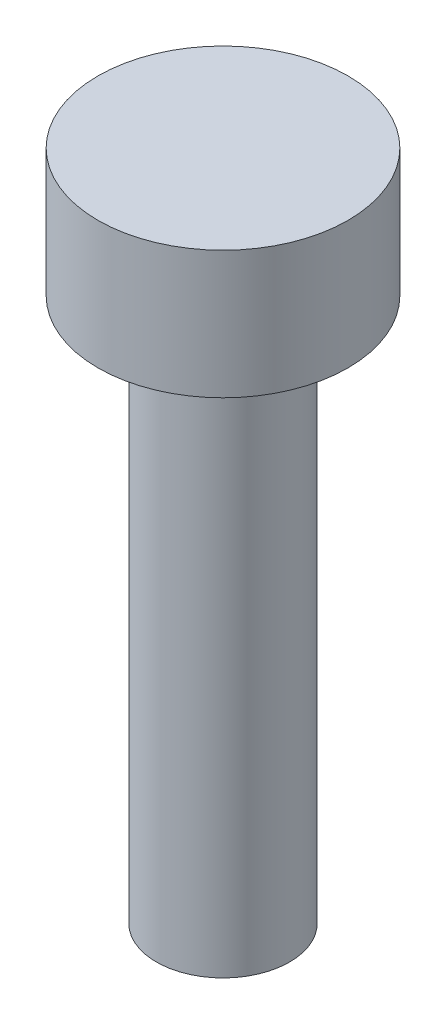
ISO-10303-21;
HEADER;
FILE_DESCRIPTION(('STEP AP214'),'2;1');
FILE_NAME('part.step','',(''),(''),'','','');
FILE_SCHEMA(('AUTOMOTIVE_DESIGN { 1 0 10303 214 1 1 1 1 }'));
ENDSEC;
DATA;
#1=APPLICATION_CONTEXT('core data for automotive mechanical design processes');
#2=APPLICATION_PROTOCOL_DEFINITION('international standard','automotive_design',2000,#1);
#3=PRODUCT_CONTEXT('',#1,'mechanical');
#4=PRODUCT('Part','Part','',(#3));
#5=PRODUCT_RELATED_PRODUCT_CATEGORY('part','',(#4));
#6=PRODUCT_DEFINITION_FORMATION('','',#4);
#7=PRODUCT_DEFINITION_CONTEXT('part definition',#1,'design');
#8=PRODUCT_DEFINITION('design','',#6,#7);
#9=PRODUCT_DEFINITION_SHAPE('','',#8);
#10=(LENGTH_UNIT() NAMED_UNIT(*) SI_UNIT(.MILLI.,.METRE.));
#11=(NAMED_UNIT(*) PLANE_ANGLE_UNIT() SI_UNIT($,.RADIAN.));
#12=(NAMED_UNIT(*) SI_UNIT($,.STERADIAN.) SOLID_ANGLE_UNIT());
#13=UNCERTAINTY_MEASURE_WITH_UNIT(LENGTH_MEASURE(1.E-05),#10,'distance_accuracy_value','');
#14=(GEOMETRIC_REPRESENTATION_CONTEXT(3) GLOBAL_UNCERTAINTY_ASSIGNED_CONTEXT((#13)) GLOBAL_UNIT_ASSIGNED_CONTEXT((#10,
#11,#12)) REPRESENTATION_CONTEXT('',''));
#15=CARTESIAN_POINT('',(0.,0.,0.));
#16=DIRECTION('',(0.,0.,1.));
#17=DIRECTION('',(1.,0.,0.));
#18=AXIS2_PLACEMENT_3D('',#15,#16,#17);
#19=CARTESIAN_POINT('',(0.,1.88,0.));
#20=DIRECTION('',(0.,-1.,0.));
#21=DIRECTION('',(0.,0.,-1.));
#22=AXIS2_PLACEMENT_3D('',#19,#20,#21);
#23=CYLINDRICAL_SURFACE('',#22,1.84);
#24=CARTESIAN_POINT('',(0.,1.88,0.));
#25=DIRECTION('',(0.,1.,0.));
#26=DIRECTION('',(0.,0.,1.));
#27=AXIS2_PLACEMENT_3D('',#24,#25,#26);
#28=CIRCLE('',#27,1.84);
#29=CARTESIAN_POINT('',(0.,1.88,1.84));
#30=VERTEX_POINT('',#29);
#31=EDGE_CURVE('E39',#30,#30,#28,.T.);
#32=ORIENTED_EDGE('',*,*,#31,.F.);
#33=EDGE_LOOP('',(#32));
#34=FACE_BOUND('',#33,.T.);
#35=CARTESIAN_POINT('',(0.,0.,0.));
#36=DIRECTION('',(0.,1.,0.));
#37=DIRECTION('',(0.,0.,1.));
#38=AXIS2_PLACEMENT_3D('',#35,#36,#37);
#39=CIRCLE('',#38,1.84);
#40=CARTESIAN_POINT('',(0.,0.,1.84));
#41=VERTEX_POINT('',#40);
#42=EDGE_CURVE('E35',#41,#41,#39,.T.);
#43=ORIENTED_EDGE('',*,*,#42,.T.);
#44=EDGE_LOOP('',(#43));
#45=FACE_BOUND('',#44,.T.);
#46=ADVANCED_FACE('F32',(#34,#45),#23,.T.);
#47=CARTESIAN_POINT('',(0.,1.88,0.));
#48=DIRECTION('',(0.,1.,0.));
#49=DIRECTION('',(0.,0.,1.));
#50=AXIS2_PLACEMENT_3D('',#47,#48,#49);
#51=PLANE('',#50);
#52=ORIENTED_EDGE('',*,*,#31,.T.);
#53=EDGE_LOOP('',(#52));
#54=FACE_BOUND('',#53,.T.);
#55=ADVANCED_FACE('F56',(#54),#51,.T.);
#56=CARTESIAN_POINT('',(0.,0.,0.));
#57=DIRECTION('',(0.,1.,0.));
#58=DIRECTION('',(0.,0.,1.));
#59=AXIS2_PLACEMENT_3D('',#56,#57,#58);
#60=PLANE('',#59);
#61=CARTESIAN_POINT('',(0.,0.,0.));
#62=DIRECTION('',(0.,-1.,0.));
#63=DIRECTION('',(0.,0.,-1.));
#64=AXIS2_PLACEMENT_3D('',#61,#62,#63);
#65=CIRCLE('',#64,0.98);
#66=CARTESIAN_POINT('',(0.,0.,-0.98));
#67=VERTEX_POINT('',#66);
#68=EDGE_CURVE('E10',#67,#67,#65,.T.);
#69=ORIENTED_EDGE('',*,*,#68,.F.);
#70=EDGE_LOOP('',(#69));
#71=FACE_BOUND('',#70,.T.);
#72=ORIENTED_EDGE('',*,*,#42,.F.);
#73=EDGE_LOOP('',(#72));
#74=FACE_BOUND('',#73,.T.);
#75=ADVANCED_FACE('F53',(#71,#74),#60,.F.);
#76=CARTESIAN_POINT('',(0.,-8.,0.));
#77=DIRECTION('',(0.,1.,0.));
#78=DIRECTION('',(0.,0.,1.));
#79=AXIS2_PLACEMENT_3D('',#76,#77,#78);
#80=CYLINDRICAL_SURFACE('',#79,0.98);
#81=CARTESIAN_POINT('',(0.,-8.,0.));
#82=DIRECTION('',(0.,-1.,0.));
#83=DIRECTION('',(0.,0.,-1.));
#84=AXIS2_PLACEMENT_3D('',#81,#82,#83);
#85=CIRCLE('',#84,0.98);
#86=CARTESIAN_POINT('',(0.,-8.,-0.98));
#87=VERTEX_POINT('',#86);
#88=EDGE_CURVE('E45',#87,#87,#85,.T.);
#89=ORIENTED_EDGE('',*,*,#88,.F.);
#90=EDGE_LOOP('',(#89));
#91=FACE_BOUND('',#90,.T.);
#92=ORIENTED_EDGE('',*,*,#68,.T.);
#93=EDGE_LOOP('',(#92));
#94=FACE_BOUND('',#93,.T.);
#95=ADVANCED_FACE('F55',(#91,#94),#80,.T.);
#96=CARTESIAN_POINT('',(0.,-8.,0.));
#97=DIRECTION('',(0.,-1.,0.));
#98=DIRECTION('',(0.,0.,-1.));
#99=AXIS2_PLACEMENT_3D('',#96,#97,#98);
#100=PLANE('',#99);
#101=ORIENTED_EDGE('',*,*,#88,.T.);
#102=EDGE_LOOP('',(#101));
#103=FACE_BOUND('',#102,.T.);
#104=ADVANCED_FACE('F62',(#103),#100,.T.);
#105=CLOSED_SHELL('',(#46,#55,#75,#95,#104));
#106=MANIFOLD_SOLID_BREP('B2',#105);
#107=ADVANCED_BREP_SHAPE_REPRESENTATION('',(#18,#106),#14);
#108=SHAPE_DEFINITION_REPRESENTATION(#9,#107);
ENDSEC;
END-ISO-10303-21;
